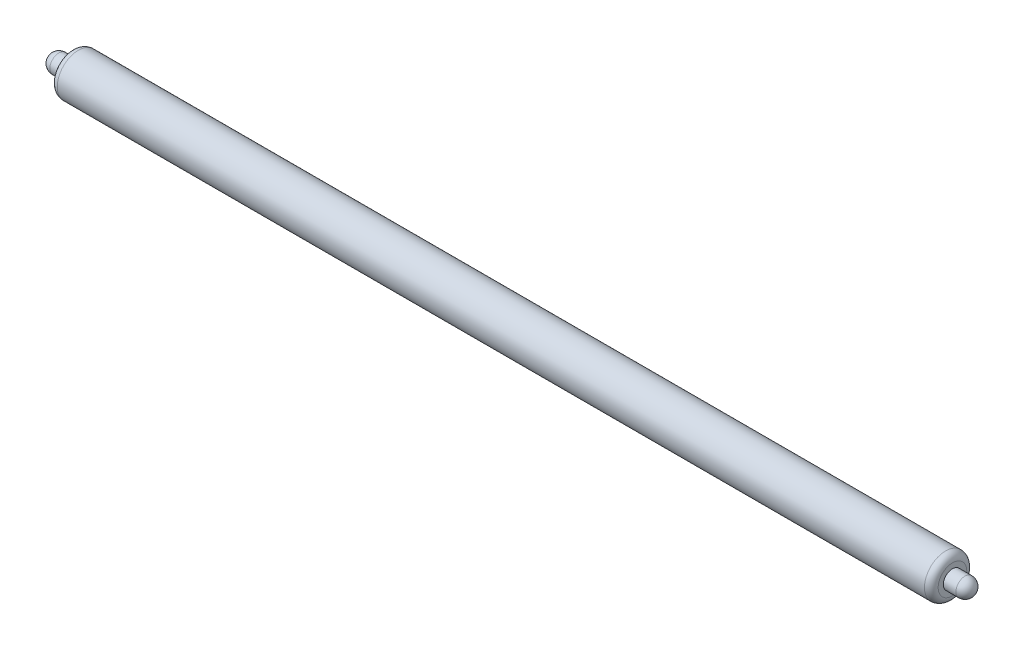
ISO-10303-21;
HEADER;
FILE_DESCRIPTION(('STEP AP214'),'2;1');
FILE_NAME('part.step','',(''),(''),'','','');
FILE_SCHEMA(('AUTOMOTIVE_DESIGN { 1 0 10303 214 1 1 1 1 }'));
ENDSEC;
DATA;
#1=APPLICATION_CONTEXT('core data for automotive mechanical design processes');
#2=APPLICATION_PROTOCOL_DEFINITION('international standard','automotive_design',2000,#1);
#3=PRODUCT_CONTEXT('',#1,'mechanical');
#4=PRODUCT('Part','Part','',(#3));
#5=PRODUCT_RELATED_PRODUCT_CATEGORY('part','',(#4));
#6=PRODUCT_DEFINITION_FORMATION('','',#4);
#7=PRODUCT_DEFINITION_CONTEXT('part definition',#1,'design');
#8=PRODUCT_DEFINITION('design','',#6,#7);
#9=PRODUCT_DEFINITION_SHAPE('','',#8);
#10=(LENGTH_UNIT() NAMED_UNIT(*) SI_UNIT(.MILLI.,.METRE.));
#11=(NAMED_UNIT(*) PLANE_ANGLE_UNIT() SI_UNIT($,.RADIAN.));
#12=(NAMED_UNIT(*) SI_UNIT($,.STERADIAN.) SOLID_ANGLE_UNIT());
#13=UNCERTAINTY_MEASURE_WITH_UNIT(LENGTH_MEASURE(1.E-05),#10,'distance_accuracy_value','');
#14=(GEOMETRIC_REPRESENTATION_CONTEXT(3) GLOBAL_UNCERTAINTY_ASSIGNED_CONTEXT((#13)) GLOBAL_UNIT_ASSIGNED_CONTEXT((#10,
#11,#12)) REPRESENTATION_CONTEXT('',''));
#15=CARTESIAN_POINT('',(0.,0.,0.));
#16=DIRECTION('',(0.,0.,1.));
#17=DIRECTION('',(1.,0.,0.));
#18=AXIS2_PLACEMENT_3D('',#15,#16,#17);
#19=CARTESIAN_POINT('',(385.,0.,0.));
#20=DIRECTION('',(-1.,0.,0.));
#21=DIRECTION('',(0.,0.,1.));
#22=AXIS2_PLACEMENT_3D('',#19,#20,#21);
#23=CYLINDRICAL_SURFACE('',#22,9.25);
#24=CARTESIAN_POINT('',(382.,0.,0.));
#25=DIRECTION('',(1.,0.,0.));
#26=DIRECTION('',(0.,0.,-1.));
#27=AXIS2_PLACEMENT_3D('',#24,#25,#26);
#28=CIRCLE('',#27,9.25);
#29=CARTESIAN_POINT('',(382.,0.,-9.25));
#30=VERTEX_POINT('',#29);
#31=EDGE_CURVE('E46',#30,#30,#28,.F.);
#32=ORIENTED_EDGE('',*,*,#31,.T.);
#33=EDGE_LOOP('',(#32));
#34=FACE_BOUND('',#33,.T.);
#35=CARTESIAN_POINT('',(3.,0.,0.));
#36=DIRECTION('',(1.,0.,0.));
#37=DIRECTION('',(0.,0.,-1.));
#38=AXIS2_PLACEMENT_3D('',#35,#36,#37);
#39=CIRCLE('',#38,9.25);
#40=CARTESIAN_POINT('',(3.,0.,-9.25));
#41=VERTEX_POINT('',#40);
#42=EDGE_CURVE('E51',#41,#41,#39,.T.);
#43=ORIENTED_EDGE('',*,*,#42,.T.);
#44=EDGE_LOOP('',(#43));
#45=FACE_BOUND('',#44,.T.);
#46=ADVANCED_FACE('F31',(#34,#45),#23,.T.);
#47=CARTESIAN_POINT('',(385.,0.,0.));
#48=DIRECTION('',(1.,0.,0.));
#49=DIRECTION('',(0.,0.,-1.));
#50=AXIS2_PLACEMENT_3D('',#47,#48,#49);
#51=PLANE('',#50);
#52=CARTESIAN_POINT('',(385.,0.,0.));
#53=DIRECTION('',(1.,0.,0.));
#54=DIRECTION('',(0.,0.,-1.));
#55=AXIS2_PLACEMENT_3D('',#52,#53,#54);
#56=CIRCLE('',#55,4.);
#57=CARTESIAN_POINT('',(385.,0.,-4.));
#58=VERTEX_POINT('',#57);
#59=EDGE_CURVE('E60',#58,#58,#56,.T.);
#60=ORIENTED_EDGE('',*,*,#59,.F.);
#61=EDGE_LOOP('',(#60));
#62=FACE_BOUND('',#61,.T.);
#63=CARTESIAN_POINT('',(385.,0.,0.));
#64=DIRECTION('',(1.,0.,0.));
#65=DIRECTION('',(0.,0.,-1.));
#66=AXIS2_PLACEMENT_3D('',#63,#64,#65);
#67=CIRCLE('',#66,6.25);
#68=CARTESIAN_POINT('',(385.,0.,-6.25));
#69=VERTEX_POINT('',#68);
#70=EDGE_CURVE('E54',#69,#69,#67,.T.);
#71=ORIENTED_EDGE('',*,*,#70,.T.);
#72=EDGE_LOOP('',(#71));
#73=FACE_BOUND('',#72,.T.);
#74=ADVANCED_FACE('F66',(#62,#73),#51,.T.);
#75=CARTESIAN_POINT('',(0.,0.,0.));
#76=DIRECTION('',(1.,0.,0.));
#77=DIRECTION('',(0.,0.,-1.));
#78=AXIS2_PLACEMENT_3D('',#75,#76,#77);
#79=PLANE('',#78);
#80=CARTESIAN_POINT('',(0.,0.,0.));
#81=DIRECTION('',(1.,0.,0.));
#82=DIRECTION('',(0.,0.,-1.));
#83=AXIS2_PLACEMENT_3D('',#80,#81,#82);
#84=CIRCLE('',#83,6.25);
#85=CARTESIAN_POINT('',(0.,0.,-6.25));
#86=VERTEX_POINT('',#85);
#87=EDGE_CURVE('E42',#86,#86,#84,.F.);
#88=ORIENTED_EDGE('',*,*,#87,.T.);
#89=EDGE_LOOP('',(#88));
#90=FACE_BOUND('',#89,.T.);
#91=CARTESIAN_POINT('',(0.,0.,0.));
#92=DIRECTION('',(-1.,0.,0.));
#93=DIRECTION('',(0.,0.,1.));
#94=AXIS2_PLACEMENT_3D('',#91,#92,#93);
#95=CIRCLE('',#94,4.);
#96=CARTESIAN_POINT('',(0.,0.,4.));
#97=VERTEX_POINT('',#96);
#98=EDGE_CURVE('E57',#97,#97,#95,.T.);
#99=ORIENTED_EDGE('',*,*,#98,.F.);
#100=EDGE_LOOP('',(#99));
#101=FACE_BOUND('',#100,.T.);
#102=ADVANCED_FACE('F69',(#90,#101),#79,.F.);
#103=CARTESIAN_POINT('',(-9.5,0.,0.));
#104=DIRECTION('',(1.,0.,0.));
#105=DIRECTION('',(0.,0.,-1.));
#106=AXIS2_PLACEMENT_3D('',#103,#104,#105);
#107=CYLINDRICAL_SURFACE('',#106,4.);
#108=CARTESIAN_POINT('',(-5.5,0.,0.));
#109=DIRECTION('',(1.,0.,0.));
#110=DIRECTION('',(0.,0.,-1.));
#111=AXIS2_PLACEMENT_3D('',#108,#109,#110);
#112=CIRCLE('',#111,4.);
#113=CARTESIAN_POINT('',(-5.5,0.,-4.));
#114=VERTEX_POINT('',#113);
#115=EDGE_CURVE('E38',#114,#114,#112,.T.);
#116=ORIENTED_EDGE('',*,*,#115,.T.);
#117=EDGE_LOOP('',(#116));
#118=FACE_BOUND('',#117,.T.);
#119=ORIENTED_EDGE('',*,*,#98,.T.);
#120=EDGE_LOOP('',(#119));
#121=FACE_BOUND('',#120,.T.);
#122=ADVANCED_FACE('F76',(#118,#121),#107,.T.);
#123=CARTESIAN_POINT('',(382.,0.,0.));
#124=DIRECTION('',(1.,0.,0.));
#125=DIRECTION('',(0.,0.,-1.));
#126=AXIS2_PLACEMENT_3D('',#123,#124,#125);
#127=TOROIDAL_SURFACE('',#126,6.25,3.);
#128=ORIENTED_EDGE('',*,*,#31,.F.);
#129=EDGE_LOOP('',(#128));
#130=FACE_BOUND('',#129,.T.);
#131=ORIENTED_EDGE('',*,*,#70,.F.);
#132=EDGE_LOOP('',(#131));
#133=FACE_BOUND('',#132,.T.);
#134=ADVANCED_FACE('F73',(#130,#133),#127,.T.);
#135=CARTESIAN_POINT('',(3.,0.,0.));
#136=DIRECTION('',(1.,0.,0.));
#137=DIRECTION('',(0.,0.,-1.));
#138=AXIS2_PLACEMENT_3D('',#135,#136,#137);
#139=TOROIDAL_SURFACE('',#138,6.25,3.);
#140=ORIENTED_EDGE('',*,*,#87,.F.);
#141=EDGE_LOOP('',(#140));
#142=FACE_BOUND('',#141,.T.);
#143=ORIENTED_EDGE('',*,*,#42,.F.);
#144=EDGE_LOOP('',(#143));
#145=FACE_BOUND('',#144,.T.);
#146=ADVANCED_FACE('F75',(#142,#145),#139,.T.);
#147=CARTESIAN_POINT('',(394.5,0.,0.));
#148=DIRECTION('',(-1.,0.,0.));
#149=DIRECTION('',(0.,0.,1.));
#150=AXIS2_PLACEMENT_3D('',#147,#148,#149);
#151=CYLINDRICAL_SURFACE('',#150,4.);
#152=CARTESIAN_POINT('',(390.5,0.,0.));
#153=DIRECTION('',(-1.,0.,0.));
#154=DIRECTION('',(0.,0.,1.));
#155=AXIS2_PLACEMENT_3D('',#152,#153,#154);
#156=CIRCLE('',#155,4.);
#157=CARTESIAN_POINT('',(390.5,0.,4.));
#158=VERTEX_POINT('',#157);
#159=EDGE_CURVE('E10',#158,#158,#156,.T.);
#160=ORIENTED_EDGE('',*,*,#159,.T.);
#161=EDGE_LOOP('',(#160));
#162=FACE_BOUND('',#161,.T.);
#163=ORIENTED_EDGE('',*,*,#59,.T.);
#164=EDGE_LOOP('',(#163));
#165=FACE_BOUND('',#164,.T.);
#166=ADVANCED_FACE('F64',(#162,#165),#151,.T.);
#167=CARTESIAN_POINT('',(-5.5,0.,0.));
#168=DIRECTION('',(-1.,0.,0.));
#169=DIRECTION('',(0.,0.,1.));
#170=AXIS2_PLACEMENT_3D('',#167,#168,#169);
#171=SPHERICAL_SURFACE('',#170,4.);
#172=ORIENTED_EDGE('',*,*,#115,.F.);
#173=EDGE_LOOP('',(#172));
#174=FACE_BOUND('',#173,.T.);
#175=ADVANCED_FACE('F98',(#174),#171,.T.);
#176=CARTESIAN_POINT('',(390.5,0.,0.));
#177=DIRECTION('',(1.,0.,0.));
#178=DIRECTION('',(0.,0.,-1.));
#179=AXIS2_PLACEMENT_3D('',#176,#177,#178);
#180=SPHERICAL_SURFACE('',#179,4.);
#181=ORIENTED_EDGE('',*,*,#159,.F.);
#182=EDGE_LOOP('',(#181));
#183=FACE_BOUND('',#182,.T.);
#184=ADVANCED_FACE('F33',(#183),#180,.T.);
#185=CLOSED_SHELL('',(#46,#74,#102,#122,#134,#146,#166,#175,#184));
#186=MANIFOLD_SOLID_BREP('B2',#185);
#187=ADVANCED_BREP_SHAPE_REPRESENTATION('',(#18,#186),#14);
#188=SHAPE_DEFINITION_REPRESENTATION(#9,#187);
ENDSEC;
END-ISO-10303-21;
